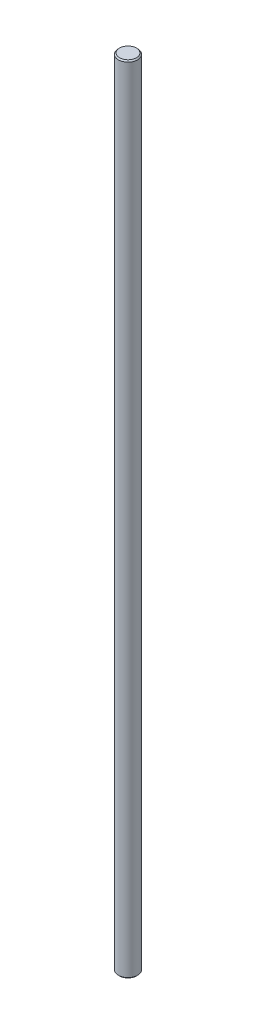
ISO-10303-21;
HEADER;
FILE_DESCRIPTION(('STEP AP214'),'2;1');
FILE_NAME('part.step','',(''),(''),'','','');
FILE_SCHEMA(('AUTOMOTIVE_DESIGN { 1 0 10303 214 1 1 1 1 }'));
ENDSEC;
DATA;
#1=APPLICATION_CONTEXT('core data for automotive mechanical design processes');
#2=APPLICATION_PROTOCOL_DEFINITION('international standard','automotive_design',2000,#1);
#3=PRODUCT_CONTEXT('',#1,'mechanical');
#4=PRODUCT('Part','Part','',(#3));
#5=PRODUCT_RELATED_PRODUCT_CATEGORY('part','',(#4));
#6=PRODUCT_DEFINITION_FORMATION('','',#4);
#7=PRODUCT_DEFINITION_CONTEXT('part definition',#1,'design');
#8=PRODUCT_DEFINITION('design','',#6,#7);
#9=PRODUCT_DEFINITION_SHAPE('','',#8);
#10=(LENGTH_UNIT() NAMED_UNIT(*) SI_UNIT(.MILLI.,.METRE.));
#11=(NAMED_UNIT(*) PLANE_ANGLE_UNIT() SI_UNIT($,.RADIAN.));
#12=(NAMED_UNIT(*) SI_UNIT($,.STERADIAN.) SOLID_ANGLE_UNIT());
#13=UNCERTAINTY_MEASURE_WITH_UNIT(LENGTH_MEASURE(1.E-05),#10,'distance_accuracy_value','');
#14=(GEOMETRIC_REPRESENTATION_CONTEXT(3) GLOBAL_UNCERTAINTY_ASSIGNED_CONTEXT((#13)) GLOBAL_UNIT_ASSIGNED_CONTEXT((#10,
#11,#12)) REPRESENTATION_CONTEXT('',''));
#15=CARTESIAN_POINT('',(0.,0.,0.));
#16=DIRECTION('',(0.,0.,1.));
#17=DIRECTION('',(1.,0.,0.));
#18=AXIS2_PLACEMENT_3D('',#15,#16,#17);
#19=CARTESIAN_POINT('',(0.,165.,0.));
#20=DIRECTION('',(0.,-1.,0.));
#21=DIRECTION('',(0.,0.,-1.));
#22=AXIS2_PLACEMENT_3D('',#19,#20,#21);
#23=CYLINDRICAL_SURFACE('',#22,4.);
#24=CARTESIAN_POINT('',(0.,-164.5,0.));
#25=DIRECTION('',(0.,1.,0.));
#26=DIRECTION('',(0.,0.,1.));
#27=AXIS2_PLACEMENT_3D('',#24,#25,#26);
#28=CIRCLE('',#27,4.);
#29=CARTESIAN_POINT('',(0.,-164.5,4.));
#30=VERTEX_POINT('',#29);
#31=EDGE_CURVE('E44',#30,#30,#28,.T.);
#32=ORIENTED_EDGE('',*,*,#31,.T.);
#33=EDGE_LOOP('',(#32));
#34=FACE_BOUND('',#33,.T.);
#35=CARTESIAN_POINT('',(0.,164.5,0.));
#36=DIRECTION('',(0.,1.,0.));
#37=DIRECTION('',(0.,0.,1.));
#38=AXIS2_PLACEMENT_3D('',#35,#36,#37);
#39=CIRCLE('',#38,4.);
#40=CARTESIAN_POINT('',(0.,164.5,4.));
#41=VERTEX_POINT('',#40);
#42=EDGE_CURVE('E48',#41,#41,#39,.F.);
#43=ORIENTED_EDGE('',*,*,#42,.T.);
#44=EDGE_LOOP('',(#43));
#45=FACE_BOUND('',#44,.T.);
#46=ADVANCED_FACE('F32',(#34,#45),#23,.T.);
#47=CARTESIAN_POINT('',(0.,165.,0.));
#48=DIRECTION('',(0.,1.,0.));
#49=DIRECTION('',(0.,0.,1.));
#50=AXIS2_PLACEMENT_3D('',#47,#48,#49);
#51=PLANE('',#50);
#52=CARTESIAN_POINT('',(0.,165.,0.));
#53=DIRECTION('',(0.,1.,0.));
#54=DIRECTION('',(0.,0.,1.));
#55=AXIS2_PLACEMENT_3D('',#52,#53,#54);
#56=CIRCLE('',#55,3.5);
#57=CARTESIAN_POINT('',(0.,165.,3.5));
#58=VERTEX_POINT('',#57);
#59=EDGE_CURVE('E10',#58,#58,#56,.T.);
#60=ORIENTED_EDGE('',*,*,#59,.T.);
#61=EDGE_LOOP('',(#60));
#62=FACE_BOUND('',#61,.T.);
#63=ADVANCED_FACE('F64',(#62),#51,.T.);
#64=CARTESIAN_POINT('',(0.,-165.,0.));
#65=DIRECTION('',(0.,1.,0.));
#66=DIRECTION('',(0.,0.,1.));
#67=AXIS2_PLACEMENT_3D('',#64,#65,#66);
#68=PLANE('',#67);
#69=CARTESIAN_POINT('',(0.,-165.,0.));
#70=DIRECTION('',(0.,1.,0.));
#71=DIRECTION('',(0.,0.,1.));
#72=AXIS2_PLACEMENT_3D('',#69,#70,#71);
#73=CIRCLE('',#72,3.49999999999998);
#74=CARTESIAN_POINT('',(0.,-165.,3.49999999999998));
#75=VERTEX_POINT('',#74);
#76=EDGE_CURVE('E40',#75,#75,#73,.F.);
#77=ORIENTED_EDGE('',*,*,#76,.T.);
#78=EDGE_LOOP('',(#77));
#79=FACE_BOUND('',#78,.T.);
#80=ADVANCED_FACE('F61',(#79),#68,.F.);
#81=CARTESIAN_POINT('',(0.,-164.5,0.));
#82=DIRECTION('',(0.,1.,0.));
#83=DIRECTION('',(0.,0.,1.));
#84=AXIS2_PLACEMENT_3D('',#81,#82,#83);
#85=CONICAL_SURFACE('',#84,4.,0.785398163397473);
#86=ORIENTED_EDGE('',*,*,#76,.F.);
#87=EDGE_LOOP('',(#86));
#88=FACE_BOUND('',#87,.T.);
#89=ORIENTED_EDGE('',*,*,#31,.F.);
#90=EDGE_LOOP('',(#89));
#91=FACE_BOUND('',#90,.T.);
#92=ADVANCED_FACE('F57',(#88,#91),#85,.T.);
#93=CARTESIAN_POINT('',(0.,165.,0.));
#94=DIRECTION('',(0.,-1.,0.));
#95=DIRECTION('',(0.,0.,-1.));
#96=AXIS2_PLACEMENT_3D('',#93,#94,#95);
#97=CONICAL_SURFACE('',#96,3.5,0.785398163397473);
#98=ORIENTED_EDGE('',*,*,#42,.F.);
#99=EDGE_LOOP('',(#98));
#100=FACE_BOUND('',#99,.T.);
#101=ORIENTED_EDGE('',*,*,#59,.F.);
#102=EDGE_LOOP('',(#101));
#103=FACE_BOUND('',#102,.T.);
#104=ADVANCED_FACE('F35',(#100,#103),#97,.T.);
#105=CLOSED_SHELL('',(#46,#63,#80,#92,#104));
#106=MANIFOLD_SOLID_BREP('B2',#105);
#107=ADVANCED_BREP_SHAPE_REPRESENTATION('',(#18,#106),#14);
#108=SHAPE_DEFINITION_REPRESENTATION(#9,#107);
ENDSEC;
END-ISO-10303-21;
